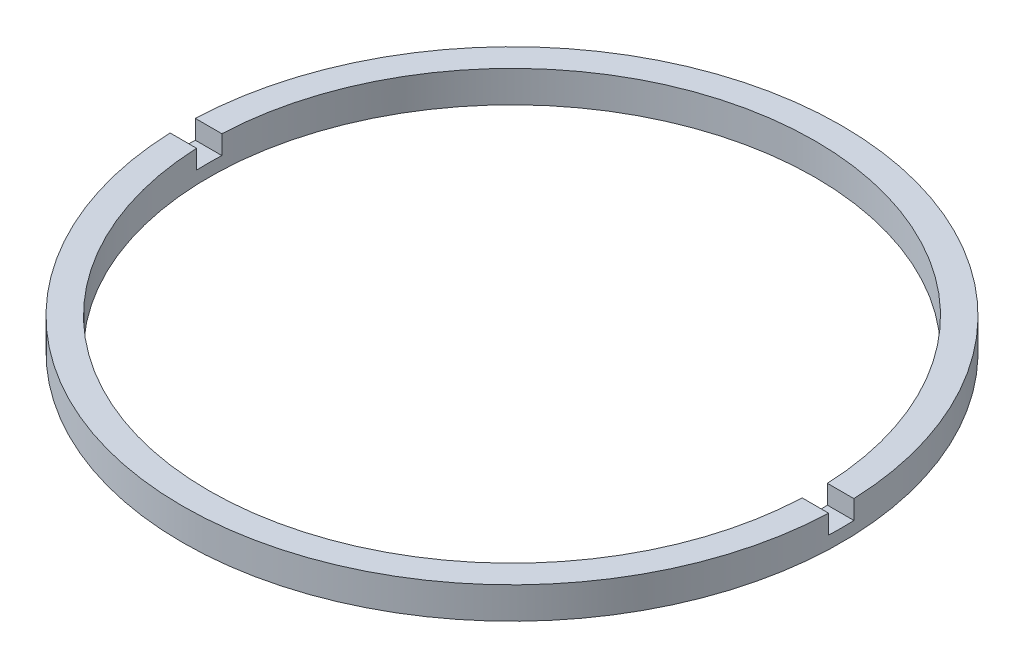
ISO-10303-21;
HEADER;
FILE_DESCRIPTION(('STEP AP214'),'2;1');
FILE_NAME('part.step','',(''),(''),'','','');
FILE_SCHEMA(('AUTOMOTIVE_DESIGN { 1 0 10303 214 1 1 1 1 }'));
ENDSEC;
DATA;
#1=APPLICATION_CONTEXT('core data for automotive mechanical design processes');
#2=APPLICATION_PROTOCOL_DEFINITION('international standard','automotive_design',2000,#1);
#3=PRODUCT_CONTEXT('',#1,'mechanical');
#4=PRODUCT('Part','Part','',(#3));
#5=PRODUCT_RELATED_PRODUCT_CATEGORY('part','',(#4));
#6=PRODUCT_DEFINITION_FORMATION('','',#4);
#7=PRODUCT_DEFINITION_CONTEXT('part definition',#1,'design');
#8=PRODUCT_DEFINITION('design','',#6,#7);
#9=PRODUCT_DEFINITION_SHAPE('','',#8);
#10=(LENGTH_UNIT() NAMED_UNIT(*) SI_UNIT(.MILLI.,.METRE.));
#11=(NAMED_UNIT(*) PLANE_ANGLE_UNIT() SI_UNIT($,.RADIAN.));
#12=(NAMED_UNIT(*) SI_UNIT($,.STERADIAN.) SOLID_ANGLE_UNIT());
#13=UNCERTAINTY_MEASURE_WITH_UNIT(LENGTH_MEASURE(1.E-05),#10,'distance_accuracy_value','');
#14=(GEOMETRIC_REPRESENTATION_CONTEXT(3) GLOBAL_UNCERTAINTY_ASSIGNED_CONTEXT((#13)) GLOBAL_UNIT_ASSIGNED_CONTEXT((#10,
#11,#12)) REPRESENTATION_CONTEXT('',''));
#15=CARTESIAN_POINT('',(0.,0.,0.));
#16=DIRECTION('',(0.,0.,1.));
#17=DIRECTION('',(1.,0.,0.));
#18=AXIS2_PLACEMENT_3D('',#15,#16,#17);
#19=CARTESIAN_POINT('',(24.,-1.96424978717943,0.));
#20=DIRECTION('',(0.,-1.,0.));
#21=DIRECTION('',(0.,0.,-1.));
#22=AXIS2_PLACEMENT_3D('',#19,#20,#21);
#23=PLANE('',#22);
#24=CARTESIAN_POINT('',(0.,-1.96424978717943,0.));
#25=DIRECTION('',(0.,1.,0.));
#26=DIRECTION('',(0.,0.,1.));
#27=AXIS2_PLACEMENT_3D('',#24,#25,#26);
#28=CIRCLE('',#27,26.1);
#29=CARTESIAN_POINT('',(-26.0808358761754,-1.96424978717943,1.));
#30=VERTEX_POINT('',#29);
#31=CARTESIAN_POINT('',(26.0808358761754,-1.96424978717943,1.));
#32=VERTEX_POINT('',#31);
#33=EDGE_CURVE('E126',#30,#32,#28,.T.);
#34=ORIENTED_EDGE('',*,*,#33,.T.);
#35=DIRECTION('',(1.,0.,0.));
#36=VECTOR('',#35,1.);
#37=CARTESIAN_POINT('',(-26.8525402726146,-1.96424978717943,1.));
#38=LINE('',#37,#36);
#39=CARTESIAN_POINT('',(23.9791576165636,-1.96424978717943,1.));
#40=VERTEX_POINT('',#39);
#41=EDGE_CURVE('E119',#40,#32,#38,.T.);
#42=ORIENTED_EDGE('',*,*,#41,.F.);
#43=CARTESIAN_POINT('',(0.,-1.96424978717943,0.));
#44=DIRECTION('',(0.,1.,0.));
#45=DIRECTION('',(0.,0.,1.));
#46=AXIS2_PLACEMENT_3D('',#43,#44,#45);
#47=CIRCLE('',#46,24.);
#48=CARTESIAN_POINT('',(-23.9791576165636,-1.96424978717943,1.));
#49=VERTEX_POINT('',#48);
#50=EDGE_CURVE('E133',#49,#40,#47,.T.);
#51=ORIENTED_EDGE('',*,*,#50,.F.);
#52=EDGE_CURVE('E148',#30,#49,#38,.T.);
#53=ORIENTED_EDGE('',*,*,#52,.F.);
#54=EDGE_LOOP('',(#34,#42,#51,#53));
#55=FACE_BOUND('',#54,.T.);
#56=ADVANCED_FACE('F36',(#55),#23,.F.);
#57=CARTESIAN_POINT('',(0.,56.2608426270136,0.));
#58=DIRECTION('',(0.,1.,0.));
#59=DIRECTION('',(0.,0.,1.));
#60=AXIS2_PLACEMENT_3D('',#57,#58,#59);
#61=CYLINDRICAL_SURFACE('',#60,26.1);
#62=CARTESIAN_POINT('',(0.,-3.46424978717943,0.));
#63=DIRECTION('',(0.,1.,0.));
#64=DIRECTION('',(0.,0.,1.));
#65=AXIS2_PLACEMENT_3D('',#62,#63,#64);
#66=CIRCLE('',#65,26.1);
#67=CARTESIAN_POINT('',(26.0808358761754,-3.46424978717943,1.));
#68=VERTEX_POINT('',#67);
#69=CARTESIAN_POINT('',(26.0808358761754,-3.46424978717943,-1.));
#70=VERTEX_POINT('',#69);
#71=EDGE_CURVE('E109',#68,#70,#66,.T.);
#72=ORIENTED_EDGE('',*,*,#71,.F.);
#73=DIRECTION('',(0.,1.,0.));
#74=VECTOR('',#73,1.);
#75=CARTESIAN_POINT('',(26.0808358761754,56.2608426270136,1.));
#76=LINE('',#75,#74);
#77=EDGE_CURVE('E161',#68,#32,#76,.T.);
#78=ORIENTED_EDGE('',*,*,#77,.T.);
#79=ORIENTED_EDGE('',*,*,#33,.F.);
#80=DIRECTION('',(0.,1.,0.));
#81=VECTOR('',#80,1.);
#82=CARTESIAN_POINT('',(-26.0808358761754,56.2608426270136,1.));
#83=LINE('',#82,#81);
#84=CARTESIAN_POINT('',(-26.0808358761754,-3.46424978717943,1.));
#85=VERTEX_POINT('',#84);
#86=EDGE_CURVE('E158',#30,#85,#83,.F.);
#87=ORIENTED_EDGE('',*,*,#86,.T.);
#88=CARTESIAN_POINT('',(-26.0808358761754,-3.46424978717943,-1.));
#89=VERTEX_POINT('',#88);
#90=EDGE_CURVE('E155',#89,#85,#66,.T.);
#91=ORIENTED_EDGE('',*,*,#90,.F.);
#92=DIRECTION('',(0.,1.,0.));
#93=VECTOR('',#92,1.);
#94=CARTESIAN_POINT('',(-26.0808358761754,56.2608426270136,-1.));
#95=LINE('',#94,#93);
#96=CARTESIAN_POINT('',(-26.0808358761754,-1.96424978717943,-1.));
#97=VERTEX_POINT('',#96);
#98=EDGE_CURVE('E108',#89,#97,#95,.T.);
#99=ORIENTED_EDGE('',*,*,#98,.T.);
#100=CARTESIAN_POINT('',(26.0808358761754,-1.96424978717943,-1.));
#101=VERTEX_POINT('',#100);
#102=EDGE_CURVE('E116',#101,#97,#28,.T.);
#103=ORIENTED_EDGE('',*,*,#102,.F.);
#104=DIRECTION('',(0.,1.,0.));
#105=VECTOR('',#104,1.);
#106=CARTESIAN_POINT('',(26.0808358761754,56.2608426270136,-1.));
#107=LINE('',#106,#105);
#108=EDGE_CURVE('E100',#101,#70,#107,.F.);
#109=ORIENTED_EDGE('',*,*,#108,.T.);
#110=EDGE_LOOP('',(#72,#78,#79,#87,#91,#99,#103,#109));
#111=FACE_BOUND('',#110,.T.);
#112=CARTESIAN_POINT('',(0.,-4.46424978717943,0.));
#113=DIRECTION('',(0.,1.,0.));
#114=DIRECTION('',(0.,0.,1.));
#115=AXIS2_PLACEMENT_3D('',#112,#113,#114);
#116=CIRCLE('',#115,26.1);
#117=CARTESIAN_POINT('',(0.,-4.46424978717943,26.1));
#118=VERTEX_POINT('',#117);
#119=EDGE_CURVE('E164',#118,#118,#116,.T.);
#120=ORIENTED_EDGE('',*,*,#119,.T.);
#121=EDGE_LOOP('',(#120));
#122=FACE_BOUND('',#121,.T.);
#123=ADVANCED_FACE('F38',(#111,#122),#61,.T.);
#124=ORIENTED_EDGE('',*,*,#102,.T.);
#125=DIRECTION('',(-1.,0.,0.));
#126=VECTOR('',#125,1.);
#127=CARTESIAN_POINT('',(-26.8525402726146,-1.96424978717943,-1.));
#128=LINE('',#127,#126);
#129=CARTESIAN_POINT('',(-23.9791576165636,-1.96424978717943,-1.));
#130=VERTEX_POINT('',#129);
#131=EDGE_CURVE('E120',#130,#97,#128,.T.);
#132=ORIENTED_EDGE('',*,*,#131,.F.);
#133=CARTESIAN_POINT('',(23.9791576165636,-1.96424978717943,-1.));
#134=VERTEX_POINT('',#133);
#135=EDGE_CURVE('E118',#134,#130,#47,.T.);
#136=ORIENTED_EDGE('',*,*,#135,.F.);
#137=EDGE_CURVE('E103',#101,#134,#128,.T.);
#138=ORIENTED_EDGE('',*,*,#137,.F.);
#139=EDGE_LOOP('',(#124,#132,#136,#138));
#140=FACE_BOUND('',#139,.T.);
#141=ADVANCED_FACE('F114',(#140),#23,.F.);
#142=CARTESIAN_POINT('',(0.,56.2608426270136,0.));
#143=DIRECTION('',(0.,1.,0.));
#144=DIRECTION('',(0.,0.,1.));
#145=AXIS2_PLACEMENT_3D('',#142,#143,#144);
#146=CYLINDRICAL_SURFACE('',#145,24.);
#147=CARTESIAN_POINT('',(0.,-3.46424978717943,0.));
#148=DIRECTION('',(0.,1.,0.));
#149=DIRECTION('',(0.,0.,1.));
#150=AXIS2_PLACEMENT_3D('',#147,#148,#149);
#151=CIRCLE('',#150,24.);
#152=CARTESIAN_POINT('',(-23.9791576165636,-3.46424978717943,1.));
#153=VERTEX_POINT('',#152);
#154=CARTESIAN_POINT('',(-23.9791576165636,-3.46424978717943,-1.));
#155=VERTEX_POINT('',#154);
#156=EDGE_CURVE('E130',#153,#155,#151,.F.);
#157=ORIENTED_EDGE('',*,*,#156,.F.);
#158=DIRECTION('',(0.,1.,0.));
#159=VECTOR('',#158,1.);
#160=CARTESIAN_POINT('',(-23.9791576165636,56.2608426270136,1.));
#161=LINE('',#160,#159);
#162=EDGE_CURVE('E11',#153,#49,#161,.T.);
#163=ORIENTED_EDGE('',*,*,#162,.T.);
#164=ORIENTED_EDGE('',*,*,#50,.T.);
#165=DIRECTION('',(0.,1.,0.));
#166=VECTOR('',#165,1.);
#167=CARTESIAN_POINT('',(23.9791576165636,56.2608426270136,1.));
#168=LINE('',#167,#166);
#169=CARTESIAN_POINT('',(23.9791576165636,-3.46424978717943,1.));
#170=VERTEX_POINT('',#169);
#171=EDGE_CURVE('E137',#40,#170,#168,.F.);
#172=ORIENTED_EDGE('',*,*,#171,.T.);
#173=CARTESIAN_POINT('',(23.9791576165636,-3.46424978717943,-1.));
#174=VERTEX_POINT('',#173);
#175=EDGE_CURVE('E125',#174,#170,#151,.F.);
#176=ORIENTED_EDGE('',*,*,#175,.F.);
#177=DIRECTION('',(0.,1.,0.));
#178=VECTOR('',#177,1.);
#179=CARTESIAN_POINT('',(23.9791576165636,56.2608426270136,-1.));
#180=LINE('',#179,#178);
#181=EDGE_CURVE('E128',#174,#134,#180,.T.);
#182=ORIENTED_EDGE('',*,*,#181,.T.);
#183=ORIENTED_EDGE('',*,*,#135,.T.);
#184=DIRECTION('',(0.,1.,0.));
#185=VECTOR('',#184,1.);
#186=CARTESIAN_POINT('',(-23.9791576165636,56.2608426270136,-1.));
#187=LINE('',#186,#185);
#188=EDGE_CURVE('E44',#130,#155,#187,.F.);
#189=ORIENTED_EDGE('',*,*,#188,.T.);
#190=EDGE_LOOP('',(#157,#163,#164,#172,#176,#182,#183,#189));
#191=FACE_BOUND('',#190,.T.);
#192=CARTESIAN_POINT('',(0.,-4.46424978717943,0.));
#193=DIRECTION('',(0.,1.,0.));
#194=DIRECTION('',(0.,0.,1.));
#195=AXIS2_PLACEMENT_3D('',#192,#193,#194);
#196=CIRCLE('',#195,24.);
#197=CARTESIAN_POINT('',(0.,-4.46424978717943,24.));
#198=VERTEX_POINT('',#197);
#199=EDGE_CURVE('E166',#198,#198,#196,.T.);
#200=ORIENTED_EDGE('',*,*,#199,.F.);
#201=EDGE_LOOP('',(#200));
#202=FACE_BOUND('',#201,.T.);
#203=ADVANCED_FACE('F172',(#191,#202),#146,.F.);
#204=CARTESIAN_POINT('',(24.,-4.46424978717943,0.));
#205=DIRECTION('',(0.,1.,0.));
#206=DIRECTION('',(0.,0.,1.));
#207=AXIS2_PLACEMENT_3D('',#204,#205,#206);
#208=PLANE('',#207);
#209=ORIENTED_EDGE('',*,*,#119,.F.);
#210=EDGE_LOOP('',(#209));
#211=FACE_BOUND('',#210,.T.);
#212=ORIENTED_EDGE('',*,*,#199,.T.);
#213=EDGE_LOOP('',(#212));
#214=FACE_BOUND('',#213,.T.);
#215=ADVANCED_FACE('F202',(#211,#214),#208,.F.);
#216=CARTESIAN_POINT('',(0.,-3.46424978717943,0.));
#217=DIRECTION('',(0.,1.,0.));
#218=DIRECTION('',(0.,0.,1.));
#219=AXIS2_PLACEMENT_3D('',#216,#217,#218);
#220=PLANE('',#219);
#221=ORIENTED_EDGE('',*,*,#71,.T.);
#222=DIRECTION('',(-1.,0.,0.));
#223=VECTOR('',#222,1.);
#224=CARTESIAN_POINT('',(-26.8525402726146,-3.46424978717943,-1.));
#225=LINE('',#224,#223);
#226=EDGE_CURVE('E59',#70,#174,#225,.T.);
#227=ORIENTED_EDGE('',*,*,#226,.T.);
#228=ORIENTED_EDGE('',*,*,#175,.T.);
#229=DIRECTION('',(1.,0.,0.));
#230=VECTOR('',#229,1.);
#231=CARTESIAN_POINT('',(-26.8525402726146,-3.46424978717943,1.));
#232=LINE('',#231,#230);
#233=EDGE_CURVE('E150',#170,#68,#232,.T.);
#234=ORIENTED_EDGE('',*,*,#233,.T.);
#235=EDGE_LOOP('',(#221,#227,#228,#234));
#236=FACE_BOUND('',#235,.T.);
#237=ADVANCED_FACE('F176',(#236),#220,.T.);
#238=CARTESIAN_POINT('',(-26.8525402726146,-3.46424978717943,-1.));
#239=DIRECTION('',(0.,0.,-1.));
#240=DIRECTION('',(-1.,0.,0.));
#241=AXIS2_PLACEMENT_3D('',#238,#239,#240);
#242=PLANE('',#241);
#243=ORIENTED_EDGE('',*,*,#137,.T.);
#244=ORIENTED_EDGE('',*,*,#181,.F.);
#245=ORIENTED_EDGE('',*,*,#226,.F.);
#246=ORIENTED_EDGE('',*,*,#108,.F.);
#247=EDGE_LOOP('',(#243,#244,#245,#246));
#248=FACE_BOUND('',#247,.T.);
#249=ADVANCED_FACE('F102',(#248),#242,.F.);
#250=CARTESIAN_POINT('',(-26.8525402726146,-3.46424978717943,1.));
#251=DIRECTION('',(0.,0.,1.));
#252=DIRECTION('',(1.,0.,0.));
#253=AXIS2_PLACEMENT_3D('',#250,#251,#252);
#254=PLANE('',#253);
#255=ORIENTED_EDGE('',*,*,#233,.F.);
#256=ORIENTED_EDGE('',*,*,#171,.F.);
#257=ORIENTED_EDGE('',*,*,#41,.T.);
#258=ORIENTED_EDGE('',*,*,#77,.F.);
#259=EDGE_LOOP('',(#255,#256,#257,#258));
#260=FACE_BOUND('',#259,.T.);
#261=ADVANCED_FACE('F178',(#260),#254,.F.);
#262=ORIENTED_EDGE('',*,*,#52,.T.);
#263=ORIENTED_EDGE('',*,*,#162,.F.);
#264=EDGE_CURVE('E51',#85,#153,#232,.T.);
#265=ORIENTED_EDGE('',*,*,#264,.F.);
#266=ORIENTED_EDGE('',*,*,#86,.F.);
#267=EDGE_LOOP('',(#262,#263,#265,#266));
#268=FACE_BOUND('',#267,.T.);
#269=ADVANCED_FACE('F184',(#268),#254,.F.);
#270=EDGE_CURVE('E145',#155,#89,#225,.T.);
#271=ORIENTED_EDGE('',*,*,#270,.F.);
#272=ORIENTED_EDGE('',*,*,#188,.F.);
#273=ORIENTED_EDGE('',*,*,#131,.T.);
#274=ORIENTED_EDGE('',*,*,#98,.F.);
#275=EDGE_LOOP('',(#271,#272,#273,#274));
#276=FACE_BOUND('',#275,.T.);
#277=ADVANCED_FACE('F147',(#276),#242,.F.);
#278=ORIENTED_EDGE('',*,*,#90,.T.);
#279=ORIENTED_EDGE('',*,*,#264,.T.);
#280=ORIENTED_EDGE('',*,*,#156,.T.);
#281=ORIENTED_EDGE('',*,*,#270,.T.);
#282=EDGE_LOOP('',(#278,#279,#280,#281));
#283=FACE_BOUND('',#282,.T.);
#284=ADVANCED_FACE('F144',(#283),#220,.T.);
#285=CLOSED_SHELL('',(#56,#123,#141,#203,#215,#237,#249,#261,#269,#277,#284));
#286=MANIFOLD_SOLID_BREP('B2',#285);
#287=ADVANCED_BREP_SHAPE_REPRESENTATION('',(#18,#286),#14);
#288=SHAPE_DEFINITION_REPRESENTATION(#9,#287);
ENDSEC;
END-ISO-10303-21;
